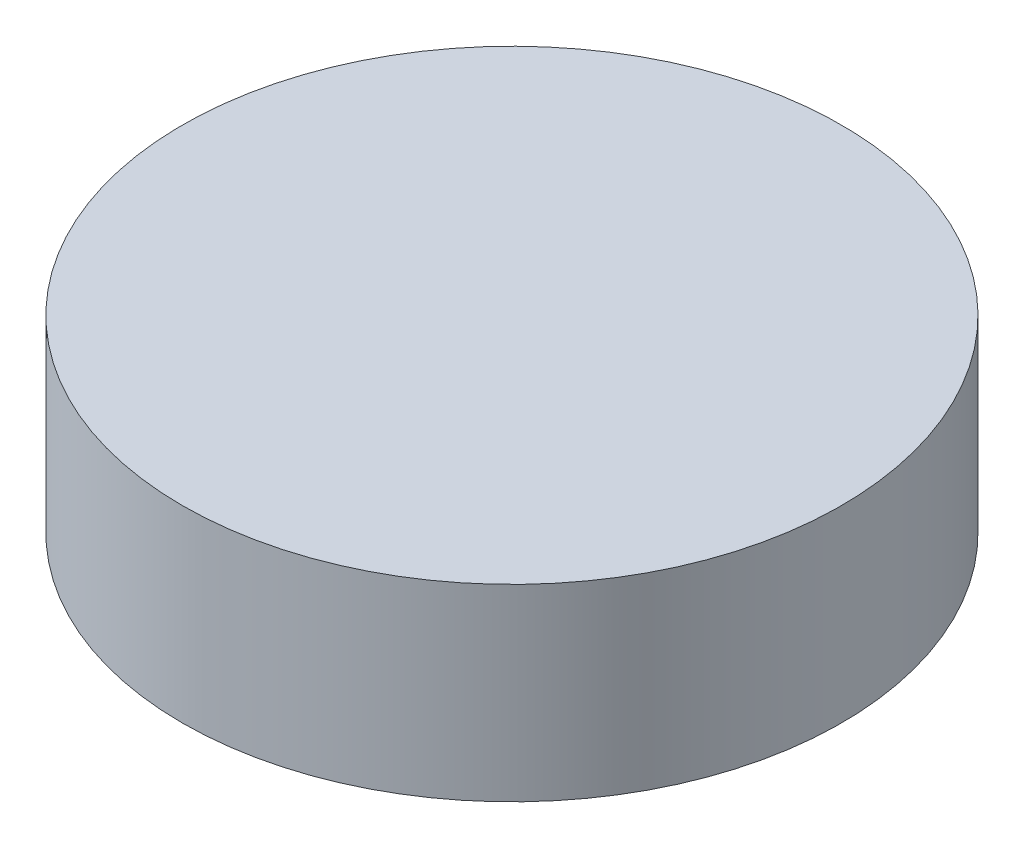
ISO-10303-21;
HEADER;
FILE_DESCRIPTION(('STEP AP214'),'2;1');
FILE_NAME('part.step','',(''),(''),'','','');
FILE_SCHEMA(('AUTOMOTIVE_DESIGN { 1 0 10303 214 1 1 1 1 }'));
ENDSEC;
DATA;
#1=APPLICATION_CONTEXT('core data for automotive mechanical design processes');
#2=APPLICATION_PROTOCOL_DEFINITION('international standard','automotive_design',2000,#1);
#3=PRODUCT_CONTEXT('',#1,'mechanical');
#4=PRODUCT('Part','Part','',(#3));
#5=PRODUCT_RELATED_PRODUCT_CATEGORY('part','',(#4));
#6=PRODUCT_DEFINITION_FORMATION('','',#4);
#7=PRODUCT_DEFINITION_CONTEXT('part definition',#1,'design');
#8=PRODUCT_DEFINITION('design','',#6,#7);
#9=PRODUCT_DEFINITION_SHAPE('','',#8);
#10=(LENGTH_UNIT() NAMED_UNIT(*) SI_UNIT(.MILLI.,.METRE.));
#11=(NAMED_UNIT(*) PLANE_ANGLE_UNIT() SI_UNIT($,.RADIAN.));
#12=(NAMED_UNIT(*) SI_UNIT($,.STERADIAN.) SOLID_ANGLE_UNIT());
#13=UNCERTAINTY_MEASURE_WITH_UNIT(LENGTH_MEASURE(1.E-05),#10,'distance_accuracy_value','');
#14=(GEOMETRIC_REPRESENTATION_CONTEXT(3) GLOBAL_UNCERTAINTY_ASSIGNED_CONTEXT((#13)) GLOBAL_UNIT_ASSIGNED_CONTEXT((#10,
#11,#12)) REPRESENTATION_CONTEXT('',''));
#15=CARTESIAN_POINT('',(0.,0.,0.));
#16=DIRECTION('',(0.,0.,1.));
#17=DIRECTION('',(1.,0.,0.));
#18=AXIS2_PLACEMENT_3D('',#15,#16,#17);
#19=CARTESIAN_POINT('',(0.,0.,0.));
#20=DIRECTION('',(0.,1.,0.));
#21=DIRECTION('',(0.,0.,1.));
#22=AXIS2_PLACEMENT_3D('',#19,#20,#21);
#23=PLANE('',#22);
#24=CARTESIAN_POINT('',(0.,0.,0.));
#25=DIRECTION('',(0.,1.,0.));
#26=DIRECTION('',(0.,0.,1.));
#27=AXIS2_PLACEMENT_3D('',#24,#25,#26);
#28=CIRCLE('',#27,1.75);
#29=CARTESIAN_POINT('',(0.,0.,1.75));
#30=VERTEX_POINT('',#29);
#31=EDGE_CURVE('E18',#30,#30,#28,.F.);
#32=ORIENTED_EDGE('',*,*,#31,.F.);
#33=EDGE_LOOP('',(#32));
#34=FACE_BOUND('',#33,.T.);
#35=ADVANCED_FACE('F15',(#34),#23,.T.);
#36=CARTESIAN_POINT('',(0.,-1.,0.));
#37=DIRECTION('',(0.,1.,0.));
#38=DIRECTION('',(0.,0.,1.));
#39=AXIS2_PLACEMENT_3D('',#36,#37,#38);
#40=CYLINDRICAL_SURFACE('',#39,1.75);
#41=ORIENTED_EDGE('',*,*,#31,.T.);
#42=EDGE_LOOP('',(#41));
#43=FACE_BOUND('',#42,.T.);
#44=CARTESIAN_POINT('',(0.,-1.,0.));
#45=DIRECTION('',(0.,1.,0.));
#46=DIRECTION('',(0.,0.,1.));
#47=AXIS2_PLACEMENT_3D('',#44,#45,#46);
#48=CIRCLE('',#47,1.75);
#49=CARTESIAN_POINT('',(0.,-1.,1.75));
#50=VERTEX_POINT('',#49);
#51=EDGE_CURVE('E10',#50,#50,#48,.T.);
#52=ORIENTED_EDGE('',*,*,#51,.T.);
#53=EDGE_LOOP('',(#52));
#54=FACE_BOUND('',#53,.T.);
#55=ADVANCED_FACE('F27',(#43,#54),#40,.T.);
#56=CARTESIAN_POINT('',(0.,-1.,0.));
#57=DIRECTION('',(0.,1.,0.));
#58=DIRECTION('',(0.,0.,1.));
#59=AXIS2_PLACEMENT_3D('',#56,#57,#58);
#60=PLANE('',#59);
#61=ORIENTED_EDGE('',*,*,#51,.F.);
#62=EDGE_LOOP('',(#61));
#63=FACE_BOUND('',#62,.T.);
#64=ADVANCED_FACE('F34',(#63),#60,.F.);
#65=CLOSED_SHELL('',(#35,#55,#64));
#66=MANIFOLD_SOLID_BREP('B1',#65);
#67=ADVANCED_BREP_SHAPE_REPRESENTATION('',(#18,#66),#14);
#68=SHAPE_DEFINITION_REPRESENTATION(#9,#67);
ENDSEC;
END-ISO-10303-21;
